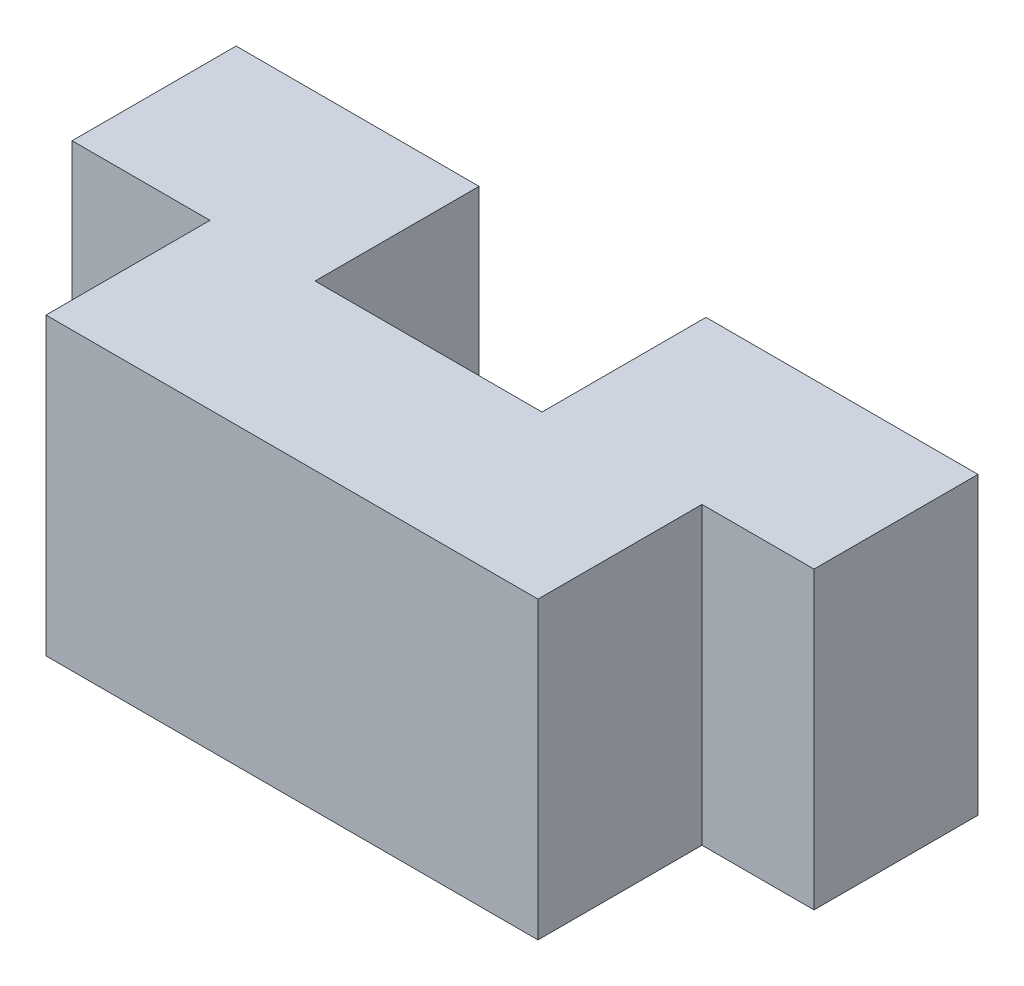
ISO-10303-21;
HEADER;
FILE_DESCRIPTION(('STEP AP214'),'2;1');
FILE_NAME('part.step','',(''),(''),'','','');
FILE_SCHEMA(('AUTOMOTIVE_DESIGN { 1 0 10303 214 1 1 1 1 }'));
ENDSEC;
DATA;
#1=APPLICATION_CONTEXT('core data for automotive mechanical design processes');
#2=APPLICATION_PROTOCOL_DEFINITION('international standard','automotive_design',2000,#1);
#3=PRODUCT_CONTEXT('',#1,'mechanical');
#4=PRODUCT('Part','Part','',(#3));
#5=PRODUCT_RELATED_PRODUCT_CATEGORY('part','',(#4));
#6=PRODUCT_DEFINITION_FORMATION('','',#4);
#7=PRODUCT_DEFINITION_CONTEXT('part definition',#1,'design');
#8=PRODUCT_DEFINITION('design','',#6,#7);
#9=PRODUCT_DEFINITION_SHAPE('','',#8);
#10=(LENGTH_UNIT() NAMED_UNIT(*) SI_UNIT(.MILLI.,.METRE.));
#11=(NAMED_UNIT(*) PLANE_ANGLE_UNIT() SI_UNIT($,.RADIAN.));
#12=(NAMED_UNIT(*) SI_UNIT($,.STERADIAN.) SOLID_ANGLE_UNIT());
#13=UNCERTAINTY_MEASURE_WITH_UNIT(LENGTH_MEASURE(1.E-05),#10,'distance_accuracy_value','');
#14=(GEOMETRIC_REPRESENTATION_CONTEXT(3) GLOBAL_UNCERTAINTY_ASSIGNED_CONTEXT((#13)) GLOBAL_UNIT_ASSIGNED_CONTEXT((#10,
#11,#12)) REPRESENTATION_CONTEXT('',''));
#15=CARTESIAN_POINT('',(0.,0.,0.));
#16=DIRECTION('',(0.,0.,1.));
#17=DIRECTION('',(1.,0.,0.));
#18=AXIS2_PLACEMENT_3D('',#15,#16,#17);
#19=CARTESIAN_POINT('',(7.5,-4.5,5.));
#20=DIRECTION('',(-1.,0.,0.));
#21=DIRECTION('',(0.,0.,1.));
#22=AXIS2_PLACEMENT_3D('',#19,#20,#21);
#23=PLANE('',#22);
#24=DIRECTION('',(0.,1.,0.));
#25=VECTOR('',#24,1.);
#26=CARTESIAN_POINT('',(7.5,-4.5,0.));
#27=LINE('',#26,#25);
#28=CARTESIAN_POINT('',(7.5,-4.5,0.));
#29=VERTEX_POINT('',#28);
#30=CARTESIAN_POINT('',(7.5,4.5,0.));
#31=VERTEX_POINT('',#30);
#32=EDGE_CURVE('E110',#29,#31,#27,.T.);
#33=ORIENTED_EDGE('',*,*,#32,.T.);
#34=DIRECTION('',(0.,0.,-1.));
#35=VECTOR('',#34,1.);
#36=CARTESIAN_POINT('',(7.5,4.5,5.));
#37=LINE('',#36,#35);
#38=CARTESIAN_POINT('',(7.5,4.5,5.));
#39=VERTEX_POINT('',#38);
#40=EDGE_CURVE('E11',#39,#31,#37,.T.);
#41=ORIENTED_EDGE('',*,*,#40,.F.);
#42=DIRECTION('',(0.,1.,0.));
#43=VECTOR('',#42,1.);
#44=CARTESIAN_POINT('',(7.5,-4.5,5.));
#45=LINE('',#44,#43);
#46=CARTESIAN_POINT('',(7.5,-4.5,5.));
#47=VERTEX_POINT('',#46);
#48=EDGE_CURVE('E92',#47,#39,#45,.T.);
#49=ORIENTED_EDGE('',*,*,#48,.F.);
#50=DIRECTION('',(0.,0.,-1.));
#51=VECTOR('',#50,1.);
#52=CARTESIAN_POINT('',(7.5,-4.5,5.));
#53=LINE('',#52,#51);
#54=EDGE_CURVE('E106',#47,#29,#53,.T.);
#55=ORIENTED_EDGE('',*,*,#54,.T.);
#56=EDGE_LOOP('',(#33,#41,#49,#55));
#57=FACE_BOUND('',#56,.T.);
#58=ADVANCED_FACE('F33',(#57),#23,.F.);
#59=CARTESIAN_POINT('',(7.5,4.5,5.));
#60=DIRECTION('',(0.,-1.,0.));
#61=DIRECTION('',(0.,0.,-1.));
#62=AXIS2_PLACEMENT_3D('',#59,#60,#61);
#63=PLANE('',#62);
#64=ORIENTED_EDGE('',*,*,#40,.T.);
#65=DIRECTION('',(-1.,0.,0.));
#66=VECTOR('',#65,1.);
#67=CARTESIAN_POINT('',(2.6220833518439,4.5,0.));
#68=LINE('',#67,#66);
#69=CARTESIAN_POINT('',(10.9148168441213,4.5,0.));
#70=VERTEX_POINT('',#69);
#71=EDGE_CURVE('E166',#70,#31,#68,.T.);
#72=ORIENTED_EDGE('',*,*,#71,.F.);
#73=DIRECTION('',(0.,0.,1.));
#74=VECTOR('',#73,1.);
#75=CARTESIAN_POINT('',(10.9148168441213,4.5,-5.));
#76=LINE('',#75,#74);
#77=CARTESIAN_POINT('',(10.9148168441213,4.5,-5.));
#78=VERTEX_POINT('',#77);
#79=EDGE_CURVE('E162',#78,#70,#76,.T.);
#80=ORIENTED_EDGE('',*,*,#79,.F.);
#81=DIRECTION('',(-1.,0.,0.));
#82=VECTOR('',#81,1.);
#83=CARTESIAN_POINT('',(2.6220833518439,4.5,-5.));
#84=LINE('',#83,#82);
#85=CARTESIAN_POINT('',(2.6220833518439,4.5,-5.));
#86=VERTEX_POINT('',#85);
#87=EDGE_CURVE('E160',#78,#86,#84,.T.);
#88=ORIENTED_EDGE('',*,*,#87,.T.);
#89=DIRECTION('',(0.,0.,1.));
#90=VECTOR('',#89,1.);
#91=CARTESIAN_POINT('',(2.6220833518439,4.5,-5.));
#92=LINE('',#91,#90);
#93=CARTESIAN_POINT('',(2.6220833518439,4.5,0.));
#94=VERTEX_POINT('',#93);
#95=EDGE_CURVE('E145',#86,#94,#92,.T.);
#96=ORIENTED_EDGE('',*,*,#95,.T.);
#97=DIRECTION('',(-1.,0.,0.));
#98=VECTOR('',#97,1.);
#99=CARTESIAN_POINT('',(7.5,4.5,0.));
#100=LINE('',#99,#98);
#101=CARTESIAN_POINT('',(-4.29642573314181,4.5,0.));
#102=VERTEX_POINT('',#101);
#103=EDGE_CURVE('E47',#94,#102,#100,.T.);
#104=ORIENTED_EDGE('',*,*,#103,.T.);
#105=DIRECTION('',(0.,0.,1.));
#106=VECTOR('',#105,1.);
#107=CARTESIAN_POINT('',(-4.29642573314181,4.5,-5.));
#108=LINE('',#107,#106);
#109=CARTESIAN_POINT('',(-4.29642573314181,4.5,-5.));
#110=VERTEX_POINT('',#109);
#111=EDGE_CURVE('E127',#110,#102,#108,.T.);
#112=ORIENTED_EDGE('',*,*,#111,.F.);
#113=DIRECTION('',(-1.,0.,0.));
#114=VECTOR('',#113,1.);
#115=CARTESIAN_POINT('',(-4.29642573314181,4.5,-5.));
#116=LINE('',#115,#114);
#117=CARTESIAN_POINT('',(-11.7046009862429,4.5,-5.));
#118=VERTEX_POINT('',#117);
#119=EDGE_CURVE('E151',#110,#118,#116,.T.);
#120=ORIENTED_EDGE('',*,*,#119,.T.);
#121=DIRECTION('',(0.,0.,1.));
#122=VECTOR('',#121,1.);
#123=CARTESIAN_POINT('',(-11.7046009862429,4.5,-5.));
#124=LINE('',#123,#122);
#125=CARTESIAN_POINT('',(-11.7046009862429,4.5,0.));
#126=VERTEX_POINT('',#125);
#127=EDGE_CURVE('E129',#118,#126,#124,.T.);
#128=ORIENTED_EDGE('',*,*,#127,.T.);
#129=DIRECTION('',(-1.,0.,0.));
#130=VECTOR('',#129,1.);
#131=CARTESIAN_POINT('',(-4.29642573314181,4.5,0.));
#132=LINE('',#131,#130);
#133=CARTESIAN_POINT('',(-7.5,4.5,0.));
#134=VERTEX_POINT('',#133);
#135=EDGE_CURVE('E100',#134,#126,#132,.T.);
#136=ORIENTED_EDGE('',*,*,#135,.F.);
#137=DIRECTION('',(0.,0.,-1.));
#138=VECTOR('',#137,1.);
#139=CARTESIAN_POINT('',(-7.5,4.5,5.));
#140=LINE('',#139,#138);
#141=CARTESIAN_POINT('',(-7.5,4.5,5.));
#142=VERTEX_POINT('',#141);
#143=EDGE_CURVE('E40',#142,#134,#140,.T.);
#144=ORIENTED_EDGE('',*,*,#143,.F.);
#145=DIRECTION('',(-1.,0.,0.));
#146=VECTOR('',#145,1.);
#147=CARTESIAN_POINT('',(7.5,4.5,5.));
#148=LINE('',#147,#146);
#149=EDGE_CURVE('E85',#39,#142,#148,.T.);
#150=ORIENTED_EDGE('',*,*,#149,.F.);
#151=EDGE_LOOP('',(#64,#72,#80,#88,#96,#104,#112,#120,#128,#136,#144,#150));
#152=FACE_BOUND('',#151,.T.);
#153=ADVANCED_FACE('F97',(#152),#63,.F.);
#154=CARTESIAN_POINT('',(-7.5,4.5,5.));
#155=DIRECTION('',(1.,0.,0.));
#156=DIRECTION('',(0.,1.,0.));
#157=AXIS2_PLACEMENT_3D('',#154,#155,#156);
#158=PLANE('',#157);
#159=DIRECTION('',(0.,-1.,0.));
#160=VECTOR('',#159,1.);
#161=CARTESIAN_POINT('',(-7.5,4.5,0.));
#162=LINE('',#161,#160);
#163=CARTESIAN_POINT('',(-7.5,-4.5,0.));
#164=VERTEX_POINT('',#163);
#165=EDGE_CURVE('E115',#134,#164,#162,.T.);
#166=ORIENTED_EDGE('',*,*,#165,.T.);
#167=DIRECTION('',(0.,0.,-1.));
#168=VECTOR('',#167,1.);
#169=CARTESIAN_POINT('',(-7.5,-4.5,5.));
#170=LINE('',#169,#168);
#171=CARTESIAN_POINT('',(-7.5,-4.5,5.));
#172=VERTEX_POINT('',#171);
#173=EDGE_CURVE('E102',#172,#164,#170,.T.);
#174=ORIENTED_EDGE('',*,*,#173,.F.);
#175=DIRECTION('',(0.,-1.,0.));
#176=VECTOR('',#175,1.);
#177=CARTESIAN_POINT('',(-7.5,4.5,5.));
#178=LINE('',#177,#176);
#179=EDGE_CURVE('E89',#142,#172,#178,.T.);
#180=ORIENTED_EDGE('',*,*,#179,.F.);
#181=ORIENTED_EDGE('',*,*,#143,.T.);
#182=EDGE_LOOP('',(#166,#174,#180,#181));
#183=FACE_BOUND('',#182,.T.);
#184=ADVANCED_FACE('F103',(#183),#158,.F.);
#185=CARTESIAN_POINT('',(-7.5,-4.5,5.));
#186=DIRECTION('',(0.,1.,0.));
#187=DIRECTION('',(-1.,0.,0.));
#188=AXIS2_PLACEMENT_3D('',#185,#186,#187);
#189=PLANE('',#188);
#190=ORIENTED_EDGE('',*,*,#173,.T.);
#191=DIRECTION('',(1.,0.,0.));
#192=VECTOR('',#191,1.);
#193=CARTESIAN_POINT('',(-4.29642573314181,-4.5,0.));
#194=LINE('',#193,#192);
#195=CARTESIAN_POINT('',(-11.7046009862429,-4.5,0.));
#196=VERTEX_POINT('',#195);
#197=EDGE_CURVE('E79',#196,#164,#194,.T.);
#198=ORIENTED_EDGE('',*,*,#197,.F.);
#199=DIRECTION('',(0.,0.,1.));
#200=VECTOR('',#199,1.);
#201=CARTESIAN_POINT('',(-11.7046009862429,-4.5,-5.));
#202=LINE('',#201,#200);
#203=CARTESIAN_POINT('',(-11.7046009862429,-4.5,-5.));
#204=VERTEX_POINT('',#203);
#205=EDGE_CURVE('E132',#204,#196,#202,.T.);
#206=ORIENTED_EDGE('',*,*,#205,.F.);
#207=DIRECTION('',(1.,0.,0.));
#208=VECTOR('',#207,1.);
#209=CARTESIAN_POINT('',(-4.29642573314181,-4.5,-5.));
#210=LINE('',#209,#208);
#211=CARTESIAN_POINT('',(-4.29642573314181,-4.5,-5.));
#212=VERTEX_POINT('',#211);
#213=EDGE_CURVE('E130',#204,#212,#210,.T.);
#214=ORIENTED_EDGE('',*,*,#213,.T.);
#215=DIRECTION('',(0.,0.,1.));
#216=VECTOR('',#215,1.);
#217=CARTESIAN_POINT('',(-4.29642573314181,-4.5,-5.));
#218=LINE('',#217,#216);
#219=CARTESIAN_POINT('',(-4.29642573314181,-4.5,0.));
#220=VERTEX_POINT('',#219);
#221=EDGE_CURVE('E113',#212,#220,#218,.T.);
#222=ORIENTED_EDGE('',*,*,#221,.T.);
#223=DIRECTION('',(1.,0.,0.));
#224=VECTOR('',#223,1.);
#225=CARTESIAN_POINT('',(-7.5,-4.5,0.));
#226=LINE('',#225,#224);
#227=CARTESIAN_POINT('',(2.6220833518439,-4.5,0.));
#228=VERTEX_POINT('',#227);
#229=EDGE_CURVE('E117',#220,#228,#226,.T.);
#230=ORIENTED_EDGE('',*,*,#229,.T.);
#231=DIRECTION('',(0.,0.,1.));
#232=VECTOR('',#231,1.);
#233=CARTESIAN_POINT('',(2.6220833518439,-4.5,-5.));
#234=LINE('',#233,#232);
#235=CARTESIAN_POINT('',(2.6220833518439,-4.5,-5.));
#236=VERTEX_POINT('',#235);
#237=EDGE_CURVE('E156',#236,#228,#234,.T.);
#238=ORIENTED_EDGE('',*,*,#237,.F.);
#239=DIRECTION('',(1.,0.,0.));
#240=VECTOR('',#239,1.);
#241=CARTESIAN_POINT('',(2.6220833518439,-4.5,-5.));
#242=LINE('',#241,#240);
#243=CARTESIAN_POINT('',(10.9148168441213,-4.5,-5.));
#244=VERTEX_POINT('',#243);
#245=EDGE_CURVE('E182',#236,#244,#242,.T.);
#246=ORIENTED_EDGE('',*,*,#245,.T.);
#247=DIRECTION('',(0.,0.,1.));
#248=VECTOR('',#247,1.);
#249=CARTESIAN_POINT('',(10.9148168441213,-4.5,-5.));
#250=LINE('',#249,#248);
#251=CARTESIAN_POINT('',(10.9148168441213,-4.5,0.));
#252=VERTEX_POINT('',#251);
#253=EDGE_CURVE('E159',#244,#252,#250,.T.);
#254=ORIENTED_EDGE('',*,*,#253,.T.);
#255=DIRECTION('',(1.,0.,0.));
#256=VECTOR('',#255,1.);
#257=CARTESIAN_POINT('',(2.6220833518439,-4.5,0.));
#258=LINE('',#257,#256);
#259=EDGE_CURVE('E68',#29,#252,#258,.T.);
#260=ORIENTED_EDGE('',*,*,#259,.F.);
#261=ORIENTED_EDGE('',*,*,#54,.F.);
#262=DIRECTION('',(1.,0.,0.));
#263=VECTOR('',#262,1.);
#264=CARTESIAN_POINT('',(-7.5,-4.5,5.));
#265=LINE('',#264,#263);
#266=EDGE_CURVE('E56',#172,#47,#265,.T.);
#267=ORIENTED_EDGE('',*,*,#266,.F.);
#268=EDGE_LOOP('',(#190,#198,#206,#214,#222,#230,#238,#246,#254,#260,#261,#267));
#269=FACE_BOUND('',#268,.T.);
#270=ADVANCED_FACE('F122',(#269),#189,.F.);
#271=CARTESIAN_POINT('',(0.,0.,5.));
#272=DIRECTION('',(0.,0.,1.));
#273=DIRECTION('',(1.,0.,0.));
#274=AXIS2_PLACEMENT_3D('',#271,#272,#273);
#275=PLANE('',#274);
#276=ORIENTED_EDGE('',*,*,#48,.T.);
#277=ORIENTED_EDGE('',*,*,#149,.T.);
#278=ORIENTED_EDGE('',*,*,#179,.T.);
#279=ORIENTED_EDGE('',*,*,#266,.T.);
#280=EDGE_LOOP('',(#276,#277,#278,#279));
#281=FACE_BOUND('',#280,.T.);
#282=ADVANCED_FACE('F87',(#281),#275,.T.);
#283=CARTESIAN_POINT('',(0.,0.,0.));
#284=DIRECTION('',(0.,0.,1.));
#285=DIRECTION('',(1.,0.,0.));
#286=AXIS2_PLACEMENT_3D('',#283,#284,#285);
#287=PLANE('',#286);
#288=ORIENTED_EDGE('',*,*,#103,.F.);
#289=DIRECTION('',(0.,-1.,0.));
#290=VECTOR('',#289,1.);
#291=CARTESIAN_POINT('',(2.6220833518439,4.5,0.));
#292=LINE('',#291,#290);
#293=EDGE_CURVE('E174',#94,#228,#292,.T.);
#294=ORIENTED_EDGE('',*,*,#293,.T.);
#295=ORIENTED_EDGE('',*,*,#229,.F.);
#296=DIRECTION('',(0.,1.,0.));
#297=VECTOR('',#296,1.);
#298=CARTESIAN_POINT('',(-4.29642573314181,4.5,0.));
#299=LINE('',#298,#297);
#300=EDGE_CURVE('E142',#220,#102,#299,.T.);
#301=ORIENTED_EDGE('',*,*,#300,.T.);
#302=EDGE_LOOP('',(#288,#294,#295,#301));
#303=FACE_BOUND('',#302,.T.);
#304=ADVANCED_FACE('F222',(#303),#287,.F.);
#305=CARTESIAN_POINT('',(-4.29642573314181,4.5,-5.));
#306=DIRECTION('',(1.,0.,0.));
#307=DIRECTION('',(0.,0.,-1.));
#308=AXIS2_PLACEMENT_3D('',#305,#306,#307);
#309=PLANE('',#308);
#310=ORIENTED_EDGE('',*,*,#300,.F.);
#311=ORIENTED_EDGE('',*,*,#221,.F.);
#312=DIRECTION('',(0.,1.,0.));
#313=VECTOR('',#312,1.);
#314=CARTESIAN_POINT('',(-4.29642573314181,4.5,-5.));
#315=LINE('',#314,#313);
#316=EDGE_CURVE('E138',#212,#110,#315,.T.);
#317=ORIENTED_EDGE('',*,*,#316,.T.);
#318=ORIENTED_EDGE('',*,*,#111,.T.);
#319=EDGE_LOOP('',(#310,#311,#317,#318));
#320=FACE_BOUND('',#319,.T.);
#321=ADVANCED_FACE('F265',(#320),#309,.T.);
#322=CARTESIAN_POINT('',(-11.7046009862429,4.5,-5.));
#323=DIRECTION('',(-1.,0.,0.));
#324=DIRECTION('',(0.,0.,1.));
#325=AXIS2_PLACEMENT_3D('',#322,#323,#324);
#326=PLANE('',#325);
#327=DIRECTION('',(0.,-1.,0.));
#328=VECTOR('',#327,1.);
#329=CARTESIAN_POINT('',(-11.7046009862429,4.5,0.));
#330=LINE('',#329,#328);
#331=EDGE_CURVE('E139',#126,#196,#330,.T.);
#332=ORIENTED_EDGE('',*,*,#331,.F.);
#333=ORIENTED_EDGE('',*,*,#127,.F.);
#334=DIRECTION('',(0.,-1.,0.));
#335=VECTOR('',#334,1.);
#336=CARTESIAN_POINT('',(-11.7046009862429,4.5,-5.));
#337=LINE('',#336,#335);
#338=EDGE_CURVE('E148',#118,#204,#337,.T.);
#339=ORIENTED_EDGE('',*,*,#338,.T.);
#340=ORIENTED_EDGE('',*,*,#205,.T.);
#341=EDGE_LOOP('',(#332,#333,#339,#340));
#342=FACE_BOUND('',#341,.T.);
#343=ADVANCED_FACE('F270',(#342),#326,.T.);
#344=CARTESIAN_POINT('',(0.,0.,-5.));
#345=DIRECTION('',(0.,0.,-1.));
#346=DIRECTION('',(-1.,0.,0.));
#347=AXIS2_PLACEMENT_3D('',#344,#345,#346);
#348=PLANE('',#347);
#349=ORIENTED_EDGE('',*,*,#316,.F.);
#350=ORIENTED_EDGE('',*,*,#213,.F.);
#351=ORIENTED_EDGE('',*,*,#338,.F.);
#352=ORIENTED_EDGE('',*,*,#119,.F.);
#353=EDGE_LOOP('',(#349,#350,#351,#352));
#354=FACE_BOUND('',#353,.T.);
#355=ADVANCED_FACE('F248',(#354),#348,.T.);
#356=CARTESIAN_POINT('',(0.,0.,0.));
#357=DIRECTION('',(0.,0.,-1.));
#358=DIRECTION('',(-1.,0.,0.));
#359=AXIS2_PLACEMENT_3D('',#356,#357,#358);
#360=PLANE('',#359);
#361=ORIENTED_EDGE('',*,*,#165,.F.);
#362=ORIENTED_EDGE('',*,*,#135,.T.);
#363=ORIENTED_EDGE('',*,*,#331,.T.);
#364=ORIENTED_EDGE('',*,*,#197,.T.);
#365=EDGE_LOOP('',(#361,#362,#363,#364));
#366=FACE_BOUND('',#365,.T.);
#367=ADVANCED_FACE('F241',(#366),#360,.F.);
#368=CARTESIAN_POINT('',(0.,0.,0.));
#369=DIRECTION('',(0.,0.,1.));
#370=DIRECTION('',(1.,0.,0.));
#371=AXIS2_PLACEMENT_3D('',#368,#369,#370);
#372=PLANE('',#371);
#373=ORIENTED_EDGE('',*,*,#32,.F.);
#374=ORIENTED_EDGE('',*,*,#259,.T.);
#375=DIRECTION('',(0.,1.,0.));
#376=VECTOR('',#375,1.);
#377=CARTESIAN_POINT('',(10.9148168441213,4.5,0.));
#378=LINE('',#377,#376);
#379=EDGE_CURVE('E170',#252,#70,#378,.T.);
#380=ORIENTED_EDGE('',*,*,#379,.T.);
#381=ORIENTED_EDGE('',*,*,#71,.T.);
#382=EDGE_LOOP('',(#373,#374,#380,#381));
#383=FACE_BOUND('',#382,.T.);
#384=ADVANCED_FACE('F239',(#383),#372,.T.);
#385=CARTESIAN_POINT('',(2.6220833518439,4.5,-5.));
#386=DIRECTION('',(-1.,0.,0.));
#387=DIRECTION('',(0.,0.,1.));
#388=AXIS2_PLACEMENT_3D('',#385,#386,#387);
#389=PLANE('',#388);
#390=ORIENTED_EDGE('',*,*,#293,.F.);
#391=ORIENTED_EDGE('',*,*,#95,.F.);
#392=DIRECTION('',(0.,-1.,0.));
#393=VECTOR('',#392,1.);
#394=CARTESIAN_POINT('',(2.6220833518439,4.5,-5.));
#395=LINE('',#394,#393);
#396=EDGE_CURVE('E169',#86,#236,#395,.T.);
#397=ORIENTED_EDGE('',*,*,#396,.T.);
#398=ORIENTED_EDGE('',*,*,#237,.T.);
#399=EDGE_LOOP('',(#390,#391,#397,#398));
#400=FACE_BOUND('',#399,.T.);
#401=ADVANCED_FACE('F191',(#400),#389,.T.);
#402=CARTESIAN_POINT('',(10.9148168441213,4.5,-5.));
#403=DIRECTION('',(1.,0.,0.));
#404=DIRECTION('',(0.,0.,-1.));
#405=AXIS2_PLACEMENT_3D('',#402,#403,#404);
#406=PLANE('',#405);
#407=ORIENTED_EDGE('',*,*,#379,.F.);
#408=ORIENTED_EDGE('',*,*,#253,.F.);
#409=DIRECTION('',(0.,1.,0.));
#410=VECTOR('',#409,1.);
#411=CARTESIAN_POINT('',(10.9148168441213,4.5,-5.));
#412=LINE('',#411,#410);
#413=EDGE_CURVE('E179',#244,#78,#412,.T.);
#414=ORIENTED_EDGE('',*,*,#413,.T.);
#415=ORIENTED_EDGE('',*,*,#79,.T.);
#416=EDGE_LOOP('',(#407,#408,#414,#415));
#417=FACE_BOUND('',#416,.T.);
#418=ADVANCED_FACE('F213',(#417),#406,.T.);
#419=CARTESIAN_POINT('',(0.,0.,-5.));
#420=DIRECTION('',(0.,0.,1.));
#421=DIRECTION('',(1.,0.,0.));
#422=AXIS2_PLACEMENT_3D('',#419,#420,#421);
#423=PLANE('',#422);
#424=ORIENTED_EDGE('',*,*,#396,.F.);
#425=ORIENTED_EDGE('',*,*,#87,.F.);
#426=ORIENTED_EDGE('',*,*,#413,.F.);
#427=ORIENTED_EDGE('',*,*,#245,.F.);
#428=EDGE_LOOP('',(#424,#425,#426,#427));
#429=FACE_BOUND('',#428,.T.);
#430=ADVANCED_FACE('F201',(#429),#423,.F.);
#431=CLOSED_SHELL('',(#58,#153,#184,#270,#282,#304,#321,#343,#355,#367,#384,#401,#418,#430));
#432=MANIFOLD_SOLID_BREP('B2',#431);
#433=ADVANCED_BREP_SHAPE_REPRESENTATION('',(#18,#432),#14);
#434=SHAPE_DEFINITION_REPRESENTATION(#9,#433);
ENDSEC;
END-ISO-10303-21;
